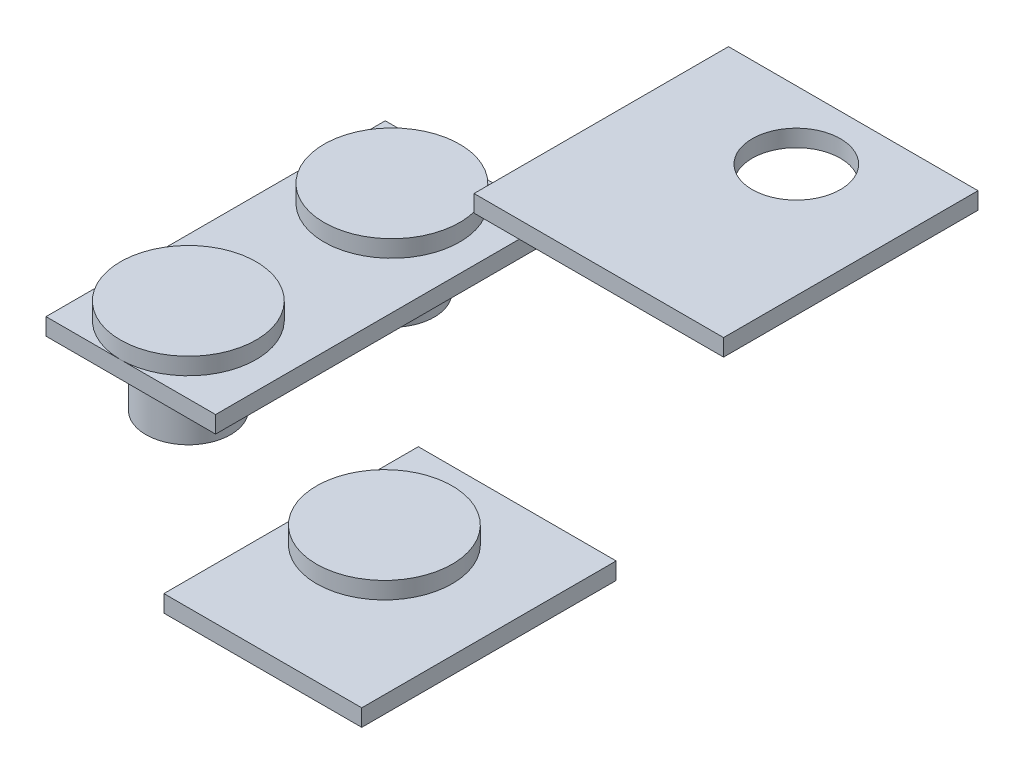
ISO-10303-21;
HEADER;
FILE_DESCRIPTION(('STEP AP214'),'2;1');
FILE_NAME('part.step','',(''),(''),'','','');
FILE_SCHEMA(('AUTOMOTIVE_DESIGN { 1 0 10303 214 1 1 1 1 }'));
ENDSEC;
DATA;
#1=APPLICATION_CONTEXT('core data for automotive mechanical design processes');
#2=APPLICATION_PROTOCOL_DEFINITION('international standard','automotive_design',2000,#1);
#3=PRODUCT_CONTEXT('',#1,'mechanical');
#4=PRODUCT('Part','Part','',(#3));
#5=PRODUCT_RELATED_PRODUCT_CATEGORY('part','',(#4));
#6=PRODUCT_DEFINITION_FORMATION('','',#4);
#7=PRODUCT_DEFINITION_CONTEXT('part definition',#1,'design');
#8=PRODUCT_DEFINITION('design','',#6,#7);
#9=PRODUCT_DEFINITION_SHAPE('','',#8);
#10=(LENGTH_UNIT() NAMED_UNIT(*) SI_UNIT(.MILLI.,.METRE.));
#11=(NAMED_UNIT(*) PLANE_ANGLE_UNIT() SI_UNIT($,.RADIAN.));
#12=(NAMED_UNIT(*) SI_UNIT($,.STERADIAN.) SOLID_ANGLE_UNIT());
#13=UNCERTAINTY_MEASURE_WITH_UNIT(LENGTH_MEASURE(1.E-05),#10,'distance_accuracy_value','');
#14=(GEOMETRIC_REPRESENTATION_CONTEXT(3) GLOBAL_UNCERTAINTY_ASSIGNED_CONTEXT((#13)) GLOBAL_UNIT_ASSIGNED_CONTEXT((#10,
#11,#12)) REPRESENTATION_CONTEXT('',''));
#15=CARTESIAN_POINT('',(0.,0.,0.));
#16=DIRECTION('',(0.,0.,1.));
#17=DIRECTION('',(1.,0.,0.));
#18=AXIS2_PLACEMENT_3D('',#15,#16,#17);
#19=CARTESIAN_POINT('',(51.4478372223601,-74.88814220189,60.));
#20=DIRECTION('',(0.,1.,0.));
#21=DIRECTION('',(0.,0.,1.));
#22=AXIS2_PLACEMENT_3D('',#19,#20,#21);
#23=PLANE('',#22);
#24=CARTESIAN_POINT('',(51.4478372223601,-74.88814220189,60.));
#25=DIRECTION('',(0.,1.,0.));
#26=DIRECTION('',(0.,0.,1.));
#27=AXIS2_PLACEMENT_3D('',#24,#25,#26);
#28=CIRCLE('',#27,25.);
#29=CARTESIAN_POINT('',(51.4478372223601,-74.88814220189,85.));
#30=VERTEX_POINT('',#29);
#31=EDGE_CURVE('E11',#30,#30,#28,.T.);
#32=ORIENTED_EDGE('',*,*,#31,.F.);
#33=EDGE_LOOP('',(#32));
#34=FACE_BOUND('',#33,.T.);
#35=ADVANCED_FACE('F46',(#34),#23,.F.);
#36=CARTESIAN_POINT('',(51.4478372223601,-19.0420232347225,60.));
#37=DIRECTION('',(0.,1.,0.));
#38=DIRECTION('',(0.,0.,1.));
#39=AXIS2_PLACEMENT_3D('',#36,#37,#38);
#40=CYLINDRICAL_SURFACE('',#39,25.);
#41=CARTESIAN_POINT('',(51.4478372223601,-29.0420232347225,60.));
#42=DIRECTION('',(0.,1.,0.));
#43=DIRECTION('',(0.,0.,1.));
#44=AXIS2_PLACEMENT_3D('',#41,#42,#43);
#45=CIRCLE('',#44,25.);
#46=CARTESIAN_POINT('',(51.4478372223601,-29.0420232347225,85.));
#47=VERTEX_POINT('',#46);
#48=EDGE_CURVE('E52',#47,#47,#45,.T.);
#49=ORIENTED_EDGE('',*,*,#48,.F.);
#50=EDGE_LOOP('',(#49));
#51=FACE_BOUND('',#50,.T.);
#52=ORIENTED_EDGE('',*,*,#31,.T.);
#53=EDGE_LOOP('',(#52));
#54=FACE_BOUND('',#53,.T.);
#55=ADVANCED_FACE('F76',(#51,#54),#40,.T.);
#56=CARTESIAN_POINT('',(76.4478372223601,-29.0420232347225,60.));
#57=DIRECTION('',(0.,1.,0.));
#58=DIRECTION('',(0.,0.,1.));
#59=AXIS2_PLACEMENT_3D('',#56,#57,#58);
#60=PLANE('',#59);
#61=CARTESIAN_POINT('',(51.4478372223601,-29.0420232347225,60.));
#62=DIRECTION('',(0.,1.,0.));
#63=DIRECTION('',(0.,0.,1.));
#64=AXIS2_PLACEMENT_3D('',#61,#62,#63);
#65=CIRCLE('',#64,40.);
#66=CARTESIAN_POINT('',(51.4478372223601,-29.0420232347225,100.));
#67=VERTEX_POINT('',#66);
#68=EDGE_CURVE('E56',#67,#67,#65,.T.);
#69=ORIENTED_EDGE('',*,*,#68,.F.);
#70=EDGE_LOOP('',(#69));
#71=FACE_BOUND('',#70,.T.);
#72=ORIENTED_EDGE('',*,*,#48,.T.);
#73=EDGE_LOOP('',(#72));
#74=FACE_BOUND('',#73,.T.);
#75=ADVANCED_FACE('F71',(#71,#74),#60,.F.);
#76=CARTESIAN_POINT('',(51.4478372223601,-19.0420232347225,60.));
#77=DIRECTION('',(0.,1.,0.));
#78=DIRECTION('',(0.,0.,1.));
#79=AXIS2_PLACEMENT_3D('',#76,#77,#78);
#80=CYLINDRICAL_SURFACE('',#79,40.);
#81=CARTESIAN_POINT('',(51.4478372223601,-19.0420232347225,60.));
#82=DIRECTION('',(0.,1.,0.));
#83=DIRECTION('',(0.,0.,1.));
#84=AXIS2_PLACEMENT_3D('',#81,#82,#83);
#85=CIRCLE('',#84,40.);
#86=CARTESIAN_POINT('',(51.4478372223601,-19.0420232347225,100.));
#87=VERTEX_POINT('',#86);
#88=EDGE_CURVE('E60',#87,#87,#85,.T.);
#89=ORIENTED_EDGE('',*,*,#88,.F.);
#90=EDGE_LOOP('',(#89));
#91=FACE_BOUND('',#90,.T.);
#92=ORIENTED_EDGE('',*,*,#68,.T.);
#93=EDGE_LOOP('',(#92));
#94=FACE_BOUND('',#93,.T.);
#95=ADVANCED_FACE('F68',(#91,#94),#80,.T.);
#96=CARTESIAN_POINT('',(91.4478372223601,-19.0420232347225,60.));
#97=DIRECTION('',(0.,-1.,0.));
#98=DIRECTION('',(0.,0.,-1.));
#99=AXIS2_PLACEMENT_3D('',#96,#97,#98);
#100=PLANE('',#99);
#101=ORIENTED_EDGE('',*,*,#88,.T.);
#102=EDGE_LOOP('',(#101));
#103=FACE_BOUND('',#102,.T.);
#104=ADVANCED_FACE('F66',(#103),#100,.F.);
#105=CLOSED_SHELL('',(#35,#55,#75,#95,#104));
#106=MANIFOLD_SOLID_BREP('B2',#105);
#107=CARTESIAN_POINT('',(-64.1485548251808,37.613727010064,0.));
#108=DIRECTION('',(0.,-1.,0.));
#109=DIRECTION('',(0.,0.,-1.));
#110=AXIS2_PLACEMENT_3D('',#107,#108,#109);
#111=PLANE('',#110);
#112=CARTESIAN_POINT('',(-64.1485548251808,37.6137270100641,-60.));
#113=DIRECTION('',(0.,1.,0.));
#114=DIRECTION('',(0.,0.,1.));
#115=AXIS2_PLACEMENT_3D('',#112,#113,#114);
#116=CIRCLE('',#115,40.);
#117=CARTESIAN_POINT('',(-64.1485548251808,37.6137270100641,-20.));
#118=VERTEX_POINT('',#117);
#119=EDGE_CURVE('E139',#118,#118,#116,.T.);
#120=ORIENTED_EDGE('',*,*,#119,.T.);
#121=EDGE_LOOP('',(#120));
#122=FACE_BOUND('',#121,.T.);
#123=ADVANCED_FACE('F125',(#122),#111,.F.);
#124=CARTESIAN_POINT('',(-64.1485548251808,-18.2323919571035,0.));
#125=DIRECTION('',(0.,1.,0.));
#126=DIRECTION('',(0.,0.,1.));
#127=AXIS2_PLACEMENT_3D('',#124,#125,#126);
#128=PLANE('',#127);
#129=CARTESIAN_POINT('',(-64.1485548251808,-18.2323919571035,-60.));
#130=DIRECTION('',(0.,1.,0.));
#131=DIRECTION('',(0.,0.,1.));
#132=AXIS2_PLACEMENT_3D('',#129,#130,#131);
#133=CIRCLE('',#132,25.);
#134=CARTESIAN_POINT('',(-64.1485548251808,-18.2323919571035,-35.));
#135=VERTEX_POINT('',#134);
#136=EDGE_CURVE('E45',#135,#135,#133,.T.);
#137=ORIENTED_EDGE('',*,*,#136,.F.);
#138=EDGE_LOOP('',(#137));
#139=FACE_BOUND('',#138,.T.);
#140=ADVANCED_FACE('F159',(#139),#128,.F.);
#141=CARTESIAN_POINT('',(-64.1485548251808,37.613727010064,-60.));
#142=DIRECTION('',(0.,1.,0.));
#143=DIRECTION('',(0.,0.,1.));
#144=AXIS2_PLACEMENT_3D('',#141,#142,#143);
#145=CYLINDRICAL_SURFACE('',#144,25.);
#146=CARTESIAN_POINT('',(-64.1485548251808,27.613727010064,-60.));
#147=DIRECTION('',(0.,1.,0.));
#148=DIRECTION('',(0.,0.,1.));
#149=AXIS2_PLACEMENT_3D('',#146,#147,#148);
#150=CIRCLE('',#149,25.);
#151=CARTESIAN_POINT('',(-64.1485548251808,27.613727010064,-35.));
#152=VERTEX_POINT('',#151);
#153=EDGE_CURVE('E131',#152,#152,#150,.T.);
#154=ORIENTED_EDGE('',*,*,#153,.F.);
#155=EDGE_LOOP('',(#154));
#156=FACE_BOUND('',#155,.T.);
#157=ORIENTED_EDGE('',*,*,#136,.T.);
#158=EDGE_LOOP('',(#157));
#159=FACE_BOUND('',#158,.T.);
#160=ADVANCED_FACE('F154',(#156,#159),#145,.T.);
#161=CARTESIAN_POINT('',(-64.1485548251808,27.613727010064,0.));
#162=DIRECTION('',(0.,1.,0.));
#163=DIRECTION('',(0.,0.,1.));
#164=AXIS2_PLACEMENT_3D('',#161,#162,#163);
#165=PLANE('',#164);
#166=CARTESIAN_POINT('',(-64.1485548251808,27.613727010064,-60.));
#167=DIRECTION('',(0.,1.,0.));
#168=DIRECTION('',(0.,0.,1.));
#169=AXIS2_PLACEMENT_3D('',#166,#167,#168);
#170=CIRCLE('',#169,40.);
#171=CARTESIAN_POINT('',(-64.1485548251808,27.613727010064,-20.));
#172=VERTEX_POINT('',#171);
#173=EDGE_CURVE('E135',#172,#172,#170,.T.);
#174=ORIENTED_EDGE('',*,*,#173,.F.);
#175=EDGE_LOOP('',(#174));
#176=FACE_BOUND('',#175,.T.);
#177=ORIENTED_EDGE('',*,*,#153,.T.);
#178=EDGE_LOOP('',(#177));
#179=FACE_BOUND('',#178,.T.);
#180=ADVANCED_FACE('F149',(#176,#179),#165,.F.);
#181=CARTESIAN_POINT('',(-64.1485548251808,37.613727010064,-60.));
#182=DIRECTION('',(0.,1.,0.));
#183=DIRECTION('',(0.,0.,1.));
#184=AXIS2_PLACEMENT_3D('',#181,#182,#183);
#185=CYLINDRICAL_SURFACE('',#184,40.);
#186=ORIENTED_EDGE('',*,*,#119,.F.);
#187=EDGE_LOOP('',(#186));
#188=FACE_BOUND('',#187,.T.);
#189=ORIENTED_EDGE('',*,*,#173,.T.);
#190=EDGE_LOOP('',(#189));
#191=FACE_BOUND('',#190,.T.);
#192=ADVANCED_FACE('F146',(#188,#191),#185,.T.);
#193=CLOSED_SHELL('',(#123,#140,#160,#180,#192));
#194=MANIFOLD_SOLID_BREP('B6',#193);
#195=CARTESIAN_POINT('',(-64.1485548251808,37.613727010064,0.));
#196=DIRECTION('',(0.,-1.,0.));
#197=DIRECTION('',(0.,0.,-1.));
#198=AXIS2_PLACEMENT_3D('',#195,#196,#197);
#199=PLANE('',#198);
#200=CARTESIAN_POINT('',(-64.1485548251808,37.613727010064,60.));
#201=DIRECTION('',(0.,1.,0.));
#202=DIRECTION('',(0.,0.,1.));
#203=AXIS2_PLACEMENT_3D('',#200,#201,#202);
#204=CIRCLE('',#203,40.);
#205=CARTESIAN_POINT('',(-64.1485548251808,37.613727010064,100.));
#206=VERTEX_POINT('',#205);
#207=EDGE_CURVE('E220',#206,#206,#204,.T.);
#208=ORIENTED_EDGE('',*,*,#207,.T.);
#209=EDGE_LOOP('',(#208));
#210=FACE_BOUND('',#209,.T.);
#211=ADVANCED_FACE('F206',(#210),#199,.F.);
#212=CARTESIAN_POINT('',(-64.1485548251808,-18.2323919571035,0.));
#213=DIRECTION('',(0.,1.,0.));
#214=DIRECTION('',(0.,0.,1.));
#215=AXIS2_PLACEMENT_3D('',#212,#213,#214);
#216=PLANE('',#215);
#217=CARTESIAN_POINT('',(-64.1485548251808,-18.2323919571035,60.));
#218=DIRECTION('',(0.,1.,0.));
#219=DIRECTION('',(0.,0.,1.));
#220=AXIS2_PLACEMENT_3D('',#217,#218,#219);
#221=CIRCLE('',#220,25.);
#222=CARTESIAN_POINT('',(-64.1485548251808,-18.2323919571035,85.));
#223=VERTEX_POINT('',#222);
#224=EDGE_CURVE('E124',#223,#223,#221,.T.);
#225=ORIENTED_EDGE('',*,*,#224,.F.);
#226=EDGE_LOOP('',(#225));
#227=FACE_BOUND('',#226,.T.);
#228=ADVANCED_FACE('F240',(#227),#216,.F.);
#229=CARTESIAN_POINT('',(-64.1485548251808,37.613727010064,60.));
#230=DIRECTION('',(0.,1.,0.));
#231=DIRECTION('',(0.,0.,1.));
#232=AXIS2_PLACEMENT_3D('',#229,#230,#231);
#233=CYLINDRICAL_SURFACE('',#232,25.);
#234=CARTESIAN_POINT('',(-64.1485548251808,27.613727010064,60.));
#235=DIRECTION('',(0.,1.,0.));
#236=DIRECTION('',(0.,0.,1.));
#237=AXIS2_PLACEMENT_3D('',#234,#235,#236);
#238=CIRCLE('',#237,25.);
#239=CARTESIAN_POINT('',(-64.1485548251808,27.613727010064,85.));
#240=VERTEX_POINT('',#239);
#241=EDGE_CURVE('E212',#240,#240,#238,.T.);
#242=ORIENTED_EDGE('',*,*,#241,.F.);
#243=EDGE_LOOP('',(#242));
#244=FACE_BOUND('',#243,.T.);
#245=ORIENTED_EDGE('',*,*,#224,.T.);
#246=EDGE_LOOP('',(#245));
#247=FACE_BOUND('',#246,.T.);
#248=ADVANCED_FACE('F235',(#244,#247),#233,.T.);
#249=CARTESIAN_POINT('',(-64.1485548251808,27.613727010064,0.));
#250=DIRECTION('',(0.,1.,0.));
#251=DIRECTION('',(0.,0.,1.));
#252=AXIS2_PLACEMENT_3D('',#249,#250,#251);
#253=PLANE('',#252);
#254=CARTESIAN_POINT('',(-64.1485548251808,27.613727010064,60.));
#255=DIRECTION('',(0.,1.,0.));
#256=DIRECTION('',(0.,0.,1.));
#257=AXIS2_PLACEMENT_3D('',#254,#255,#256);
#258=CIRCLE('',#257,40.);
#259=CARTESIAN_POINT('',(-64.1485548251808,27.613727010064,100.));
#260=VERTEX_POINT('',#259);
#261=EDGE_CURVE('E216',#260,#260,#258,.T.);
#262=ORIENTED_EDGE('',*,*,#261,.F.);
#263=EDGE_LOOP('',(#262));
#264=FACE_BOUND('',#263,.T.);
#265=ORIENTED_EDGE('',*,*,#241,.T.);
#266=EDGE_LOOP('',(#265));
#267=FACE_BOUND('',#266,.T.);
#268=ADVANCED_FACE('F230',(#264,#267),#253,.F.);
#269=CARTESIAN_POINT('',(-64.1485548251808,37.613727010064,60.));
#270=DIRECTION('',(0.,1.,0.));
#271=DIRECTION('',(0.,0.,1.));
#272=AXIS2_PLACEMENT_3D('',#269,#270,#271);
#273=CYLINDRICAL_SURFACE('',#272,40.);
#274=ORIENTED_EDGE('',*,*,#207,.F.);
#275=EDGE_LOOP('',(#274));
#276=FACE_BOUND('',#275,.T.);
#277=ORIENTED_EDGE('',*,*,#261,.T.);
#278=EDGE_LOOP('',(#277));
#279=FACE_BOUND('',#278,.T.);
#280=ADVANCED_FACE('F227',(#276,#279),#273,.T.);
#281=CLOSED_SHELL('',(#211,#228,#248,#268,#280));
#282=MANIFOLD_SOLID_BREP('B40',#281);
#283=CARTESIAN_POINT('',(44.2986503895052,106.644191680443,-150.));
#284=DIRECTION('',(0.,-1.,0.));
#285=DIRECTION('',(0.,0.,-1.));
#286=AXIS2_PLACEMENT_3D('',#283,#284,#285);
#287=PLANE('',#286);
#288=CARTESIAN_POINT('',(124.298650389505,106.644191680443,-110.));
#289=DIRECTION('',(0.,-1.,0.));
#290=DIRECTION('',(0.,0.,-1.));
#291=AXIS2_PLACEMENT_3D('',#288,#289,#290);
#292=CIRCLE('',#291,26.);
#293=CARTESIAN_POINT('',(124.298650389505,106.644191680443,-136.));
#294=VERTEX_POINT('',#293);
#295=EDGE_CURVE('E357',#294,#294,#292,.T.);
#296=ORIENTED_EDGE('',*,*,#295,.F.);
#297=EDGE_LOOP('',(#296));
#298=FACE_BOUND('',#297,.T.);
#299=DIRECTION('',(1.,0.,0.));
#300=VECTOR('',#299,1.);
#301=CARTESIAN_POINT('',(44.2986503895052,106.644191680443,0.));
#302=LINE('',#301,#300);
#303=CARTESIAN_POINT('',(44.2986503895052,106.644191680443,0.));
#304=VERTEX_POINT('',#303);
#305=CARTESIAN_POINT('',(191.413161529329,106.644191680443,0.));
#306=VERTEX_POINT('',#305);
#307=EDGE_CURVE('E353',#304,#306,#302,.T.);
#308=ORIENTED_EDGE('',*,*,#307,.F.);
#309=DIRECTION('',(0.,0.,1.));
#310=VECTOR('',#309,1.);
#311=CARTESIAN_POINT('',(44.2986503895052,106.644191680443,-150.));
#312=LINE('',#311,#310);
#313=CARTESIAN_POINT('',(44.2986503895052,106.644191680443,-150.));
#314=VERTEX_POINT('',#313);
#315=EDGE_CURVE('E204',#314,#304,#312,.T.);
#316=ORIENTED_EDGE('',*,*,#315,.F.);
#317=DIRECTION('',(1.,0.,0.));
#318=VECTOR('',#317,1.);
#319=CARTESIAN_POINT('',(44.2986503895052,106.644191680443,-150.));
#320=LINE('',#319,#318);
#321=CARTESIAN_POINT('',(191.413161529329,106.644191680443,-150.));
#322=VERTEX_POINT('',#321);
#323=EDGE_CURVE('E347',#314,#322,#320,.T.);
#324=ORIENTED_EDGE('',*,*,#323,.T.);
#325=DIRECTION('',(0.,0.,1.));
#326=VECTOR('',#325,1.);
#327=CARTESIAN_POINT('',(191.413161529329,106.644191680443,-150.));
#328=LINE('',#327,#326);
#329=EDGE_CURVE('E290',#322,#306,#328,.T.);
#330=ORIENTED_EDGE('',*,*,#329,.T.);
#331=EDGE_LOOP('',(#308,#316,#324,#330));
#332=FACE_BOUND('',#331,.T.);
#333=ADVANCED_FACE('F287',(#298,#332),#287,.T.);
#334=CARTESIAN_POINT('',(44.2986503895052,106.644191680443,-150.));
#335=DIRECTION('',(1.,0.,0.));
#336=DIRECTION('',(0.,0.,-1.));
#337=AXIS2_PLACEMENT_3D('',#334,#335,#336);
#338=PLANE('',#337);
#339=DIRECTION('',(0.,1.,0.));
#340=VECTOR('',#339,1.);
#341=CARTESIAN_POINT('',(44.2986503895052,106.644191680443,0.));
#342=LINE('',#341,#340);
#343=CARTESIAN_POINT('',(44.2986503895052,116.644191680443,0.));
#344=VERTEX_POINT('',#343);
#345=EDGE_CURVE('E320',#304,#344,#342,.T.);
#346=ORIENTED_EDGE('',*,*,#345,.T.);
#347=DIRECTION('',(0.,0.,1.));
#348=VECTOR('',#347,1.);
#349=CARTESIAN_POINT('',(44.2986503895052,116.644191680443,-150.));
#350=LINE('',#349,#348);
#351=CARTESIAN_POINT('',(44.2986503895052,116.644191680443,-150.));
#352=VERTEX_POINT('',#351);
#353=EDGE_CURVE('E296',#352,#344,#350,.T.);
#354=ORIENTED_EDGE('',*,*,#353,.F.);
#355=DIRECTION('',(0.,1.,0.));
#356=VECTOR('',#355,1.);
#357=CARTESIAN_POINT('',(44.2986503895052,106.644191680443,-150.));
#358=LINE('',#357,#356);
#359=EDGE_CURVE('E335',#314,#352,#358,.T.);
#360=ORIENTED_EDGE('',*,*,#359,.F.);
#361=ORIENTED_EDGE('',*,*,#315,.T.);
#362=EDGE_LOOP('',(#346,#354,#360,#361));
#363=FACE_BOUND('',#362,.T.);
#364=ADVANCED_FACE('F364',(#363),#338,.F.);
#365=CARTESIAN_POINT('',(44.2986503895052,116.644191680443,-150.));
#366=DIRECTION('',(0.,-1.,0.));
#367=DIRECTION('',(0.,0.,-1.));
#368=AXIS2_PLACEMENT_3D('',#365,#366,#367);
#369=PLANE('',#368);
#370=CARTESIAN_POINT('',(124.298650389505,116.644191680443,-110.));
#371=DIRECTION('',(0.,1.,0.));
#372=DIRECTION('',(0.,0.,1.));
#373=AXIS2_PLACEMENT_3D('',#370,#371,#372);
#374=CIRCLE('',#373,26.);
#375=CARTESIAN_POINT('',(124.298650389505,116.644191680443,-84.));
#376=VERTEX_POINT('',#375);
#377=EDGE_CURVE('E373',#376,#376,#374,.T.);
#378=ORIENTED_EDGE('',*,*,#377,.F.);
#379=EDGE_LOOP('',(#378));
#380=FACE_BOUND('',#379,.T.);
#381=DIRECTION('',(1.,0.,0.));
#382=VECTOR('',#381,1.);
#383=CARTESIAN_POINT('',(44.2986503895052,116.644191680443,0.));
#384=LINE('',#383,#382);
#385=CARTESIAN_POINT('',(191.413161529329,116.644191680443,0.));
#386=VERTEX_POINT('',#385);
#387=EDGE_CURVE('E342',#344,#386,#384,.T.);
#388=ORIENTED_EDGE('',*,*,#387,.T.);
#389=DIRECTION('',(0.,0.,1.));
#390=VECTOR('',#389,1.);
#391=CARTESIAN_POINT('',(191.413161529329,116.644191680443,-150.));
#392=LINE('',#391,#390);
#393=CARTESIAN_POINT('',(191.413161529329,116.644191680443,-150.));
#394=VERTEX_POINT('',#393);
#395=EDGE_CURVE('E339',#394,#386,#392,.T.);
#396=ORIENTED_EDGE('',*,*,#395,.F.);
#397=DIRECTION('',(1.,0.,0.));
#398=VECTOR('',#397,1.);
#399=CARTESIAN_POINT('',(44.2986503895052,116.644191680443,-150.));
#400=LINE('',#399,#398);
#401=EDGE_CURVE('E332',#352,#394,#400,.T.);
#402=ORIENTED_EDGE('',*,*,#401,.F.);
#403=ORIENTED_EDGE('',*,*,#353,.T.);
#404=EDGE_LOOP('',(#388,#396,#402,#403));
#405=FACE_BOUND('',#404,.T.);
#406=ADVANCED_FACE('F340',(#380,#405),#369,.F.);
#407=CARTESIAN_POINT('',(191.413161529329,116.644191680443,-150.));
#408=DIRECTION('',(-1.,0.,0.));
#409=DIRECTION('',(0.,0.,1.));
#410=AXIS2_PLACEMENT_3D('',#407,#408,#409);
#411=PLANE('',#410);
#412=DIRECTION('',(0.,-1.,0.));
#413=VECTOR('',#412,1.);
#414=CARTESIAN_POINT('',(191.413161529329,116.644191680443,0.));
#415=LINE('',#414,#413);
#416=EDGE_CURVE('E356',#386,#306,#415,.T.);
#417=ORIENTED_EDGE('',*,*,#416,.T.);
#418=ORIENTED_EDGE('',*,*,#329,.F.);
#419=DIRECTION('',(0.,-1.,0.));
#420=VECTOR('',#419,1.);
#421=CARTESIAN_POINT('',(191.413161529329,116.644191680443,-150.));
#422=LINE('',#421,#420);
#423=EDGE_CURVE('E329',#394,#322,#422,.T.);
#424=ORIENTED_EDGE('',*,*,#423,.F.);
#425=ORIENTED_EDGE('',*,*,#395,.T.);
#426=EDGE_LOOP('',(#417,#418,#424,#425));
#427=FACE_BOUND('',#426,.T.);
#428=ADVANCED_FACE('F346',(#427),#411,.F.);
#429=CARTESIAN_POINT('',(0.,0.,-150.));
#430=DIRECTION('',(0.,0.,-1.));
#431=DIRECTION('',(-1.,0.,0.));
#432=AXIS2_PLACEMENT_3D('',#429,#430,#431);
#433=PLANE('',#432);
#434=ORIENTED_EDGE('',*,*,#323,.F.);
#435=ORIENTED_EDGE('',*,*,#359,.T.);
#436=ORIENTED_EDGE('',*,*,#401,.T.);
#437=ORIENTED_EDGE('',*,*,#423,.T.);
#438=EDGE_LOOP('',(#434,#435,#436,#437));
#439=FACE_BOUND('',#438,.T.);
#440=ADVANCED_FACE('F334',(#439),#433,.T.);
#441=CARTESIAN_POINT('',(0.,0.,0.));
#442=DIRECTION('',(0.,0.,-1.));
#443=DIRECTION('',(-1.,0.,0.));
#444=AXIS2_PLACEMENT_3D('',#441,#442,#443);
#445=PLANE('',#444);
#446=ORIENTED_EDGE('',*,*,#307,.T.);
#447=ORIENTED_EDGE('',*,*,#416,.F.);
#448=ORIENTED_EDGE('',*,*,#387,.F.);
#449=ORIENTED_EDGE('',*,*,#345,.F.);
#450=EDGE_LOOP('',(#446,#447,#448,#449));
#451=FACE_BOUND('',#450,.T.);
#452=ADVANCED_FACE('F362',(#451),#445,.F.);
#453=CARTESIAN_POINT('',(124.298650389505,116.644191680443,-110.));
#454=DIRECTION('',(0.,1.,0.));
#455=DIRECTION('',(0.,0.,1.));
#456=AXIS2_PLACEMENT_3D('',#453,#454,#455);
#457=CYLINDRICAL_SURFACE('',#456,26.);
#458=ORIENTED_EDGE('',*,*,#295,.T.);
#459=EDGE_LOOP('',(#458));
#460=FACE_BOUND('',#459,.T.);
#461=ORIENTED_EDGE('',*,*,#377,.T.);
#462=EDGE_LOOP('',(#461));
#463=FACE_BOUND('',#462,.T.);
#464=ADVANCED_FACE('F378',(#460,#463),#457,.F.);
#465=CLOSED_SHELL('',(#333,#364,#406,#428,#440,#452,#464));
#466=MANIFOLD_SOLID_BREP('B119',#465);
#467=CARTESIAN_POINT('',(11.4478372223601,-39.0420232347225,150.));
#468=DIRECTION('',(0.,1.,0.));
#469=DIRECTION('',(0.,0.,1.));
#470=AXIS2_PLACEMENT_3D('',#467,#468,#469);
#471=PLANE('',#470);
#472=CARTESIAN_POINT('',(51.4478372223601,-39.0420232347225,60.));
#473=DIRECTION('',(0.,1.,0.));
#474=DIRECTION('',(0.,0.,1.));
#475=AXIS2_PLACEMENT_3D('',#472,#473,#474);
#476=CIRCLE('',#475,26.);
#477=CARTESIAN_POINT('',(51.4478372223601,-39.0420232347225,86.));
#478=VERTEX_POINT('',#477);
#479=EDGE_CURVE('E506',#478,#478,#476,.T.);
#480=ORIENTED_EDGE('',*,*,#479,.T.);
#481=EDGE_LOOP('',(#480));
#482=FACE_BOUND('',#481,.T.);
#483=DIRECTION('',(1.,0.,0.));
#484=VECTOR('',#483,1.);
#485=CARTESIAN_POINT('',(11.4478372223601,-39.0420232347225,0.));
#486=LINE('',#485,#484);
#487=CARTESIAN_POINT('',(11.4478372223601,-39.0420232347225,0.));
#488=VERTEX_POINT('',#487);
#489=CARTESIAN_POINT('',(128.092028902803,-39.0420232347225,0.));
#490=VERTEX_POINT('',#489);
#491=EDGE_CURVE('E504',#488,#490,#486,.T.);
#492=ORIENTED_EDGE('',*,*,#491,.T.);
#493=DIRECTION('',(0.,0.,-1.));
#494=VECTOR('',#493,1.);
#495=CARTESIAN_POINT('',(128.092028902803,-39.0420232347225,150.));
#496=LINE('',#495,#494);
#497=CARTESIAN_POINT('',(128.092028902803,-39.0420232347225,150.));
#498=VERTEX_POINT('',#497);
#499=EDGE_CURVE('E285',#498,#490,#496,.T.);
#500=ORIENTED_EDGE('',*,*,#499,.F.);
#501=DIRECTION('',(1.,0.,0.));
#502=VECTOR('',#501,1.);
#503=CARTESIAN_POINT('',(11.4478372223601,-39.0420232347225,150.));
#504=LINE('',#503,#502);
#505=CARTESIAN_POINT('',(11.4478372223601,-39.0420232347225,150.));
#506=VERTEX_POINT('',#505);
#507=EDGE_CURVE('E481',#506,#498,#504,.T.);
#508=ORIENTED_EDGE('',*,*,#507,.F.);
#509=DIRECTION('',(0.,0.,-1.));
#510=VECTOR('',#509,1.);
#511=CARTESIAN_POINT('',(11.4478372223601,-39.0420232347225,150.));
#512=LINE('',#511,#510);
#513=EDGE_CURVE('E457',#506,#488,#512,.T.);
#514=ORIENTED_EDGE('',*,*,#513,.T.);
#515=EDGE_LOOP('',(#492,#500,#508,#514));
#516=FACE_BOUND('',#515,.T.);
#517=ADVANCED_FACE('F441',(#482,#516),#471,.F.);
#518=CARTESIAN_POINT('',(128.092028902803,-29.0420232347225,150.));
#519=DIRECTION('',(1.,0.,0.));
#520=DIRECTION('',(0.,0.,-1.));
#521=AXIS2_PLACEMENT_3D('',#518,#519,#520);
#522=PLANE('',#521);
#523=DIRECTION('',(0.,-1.,0.));
#524=VECTOR('',#523,1.);
#525=CARTESIAN_POINT('',(128.092028902803,-29.0420232347225,0.));
#526=LINE('',#525,#524);
#527=CARTESIAN_POINT('',(128.092028902803,-29.0420232347225,0.));
#528=VERTEX_POINT('',#527);
#529=EDGE_CURVE('E490',#528,#490,#526,.T.);
#530=ORIENTED_EDGE('',*,*,#529,.F.);
#531=DIRECTION('',(0.,0.,-1.));
#532=VECTOR('',#531,1.);
#533=CARTESIAN_POINT('',(128.092028902803,-29.0420232347225,150.));
#534=LINE('',#533,#532);
#535=CARTESIAN_POINT('',(128.092028902803,-29.0420232347225,150.));
#536=VERTEX_POINT('',#535);
#537=EDGE_CURVE('E449',#536,#528,#534,.T.);
#538=ORIENTED_EDGE('',*,*,#537,.F.);
#539=DIRECTION('',(0.,-1.,0.));
#540=VECTOR('',#539,1.);
#541=CARTESIAN_POINT('',(128.092028902803,-29.0420232347225,150.));
#542=LINE('',#541,#540);
#543=EDGE_CURVE('E488',#536,#498,#542,.T.);
#544=ORIENTED_EDGE('',*,*,#543,.T.);
#545=ORIENTED_EDGE('',*,*,#499,.T.);
#546=EDGE_LOOP('',(#530,#538,#544,#545));
#547=FACE_BOUND('',#546,.T.);
#548=ADVANCED_FACE('F487',(#547),#522,.T.);
#549=CARTESIAN_POINT('',(11.4478372223601,-29.0420232347225,150.));
#550=DIRECTION('',(0.,1.,0.));
#551=DIRECTION('',(0.,0.,1.));
#552=AXIS2_PLACEMENT_3D('',#549,#550,#551);
#553=PLANE('',#552);
#554=CARTESIAN_POINT('',(51.4478372223601,-29.0420232347225,60.));
#555=DIRECTION('',(0.,1.,0.));
#556=DIRECTION('',(0.,0.,1.));
#557=AXIS2_PLACEMENT_3D('',#554,#555,#556);
#558=CIRCLE('',#557,26.);
#559=CARTESIAN_POINT('',(51.4478372223601,-29.0420232347225,86.));
#560=VERTEX_POINT('',#559);
#561=EDGE_CURVE('E518',#560,#560,#558,.T.);
#562=ORIENTED_EDGE('',*,*,#561,.F.);
#563=EDGE_LOOP('',(#562));
#564=FACE_BOUND('',#563,.T.);
#565=DIRECTION('',(1.,0.,0.));
#566=VECTOR('',#565,1.);
#567=CARTESIAN_POINT('',(11.4478372223601,-29.0420232347225,0.));
#568=LINE('',#567,#566);
#569=CARTESIAN_POINT('',(11.4478372223601,-29.0420232347225,0.));
#570=VERTEX_POINT('',#569);
#571=EDGE_CURVE('E508',#570,#528,#568,.T.);
#572=ORIENTED_EDGE('',*,*,#571,.F.);
#573=DIRECTION('',(0.,0.,-1.));
#574=VECTOR('',#573,1.);
#575=CARTESIAN_POINT('',(11.4478372223601,-29.0420232347225,150.));
#576=LINE('',#575,#574);
#577=CARTESIAN_POINT('',(11.4478372223601,-29.0420232347225,150.));
#578=VERTEX_POINT('',#577);
#579=EDGE_CURVE('E470',#578,#570,#576,.T.);
#580=ORIENTED_EDGE('',*,*,#579,.F.);
#581=DIRECTION('',(1.,0.,0.));
#582=VECTOR('',#581,1.);
#583=CARTESIAN_POINT('',(11.4478372223601,-29.0420232347225,150.));
#584=LINE('',#583,#582);
#585=EDGE_CURVE('E496',#578,#536,#584,.T.);
#586=ORIENTED_EDGE('',*,*,#585,.T.);
#587=ORIENTED_EDGE('',*,*,#537,.T.);
#588=EDGE_LOOP('',(#572,#580,#586,#587));
#589=FACE_BOUND('',#588,.T.);
#590=ADVANCED_FACE('F498',(#564,#589),#553,.T.);
#591=CARTESIAN_POINT('',(11.4478372223601,-39.0420232347225,150.));
#592=DIRECTION('',(-1.,0.,0.));
#593=DIRECTION('',(0.,0.,1.));
#594=AXIS2_PLACEMENT_3D('',#591,#592,#593);
#595=PLANE('',#594);
#596=DIRECTION('',(0.,1.,0.));
#597=VECTOR('',#596,1.);
#598=CARTESIAN_POINT('',(11.4478372223601,-39.0420232347225,0.));
#599=LINE('',#598,#597);
#600=EDGE_CURVE('E510',#488,#570,#599,.T.);
#601=ORIENTED_EDGE('',*,*,#600,.F.);
#602=ORIENTED_EDGE('',*,*,#513,.F.);
#603=DIRECTION('',(0.,1.,0.));
#604=VECTOR('',#603,1.);
#605=CARTESIAN_POINT('',(11.4478372223601,-39.0420232347225,150.));
#606=LINE('',#605,#604);
#607=EDGE_CURVE('E499',#506,#578,#606,.T.);
#608=ORIENTED_EDGE('',*,*,#607,.T.);
#609=ORIENTED_EDGE('',*,*,#579,.T.);
#610=EDGE_LOOP('',(#601,#602,#608,#609));
#611=FACE_BOUND('',#610,.T.);
#612=ADVANCED_FACE('F525',(#611),#595,.T.);
#613=CARTESIAN_POINT('',(0.,0.,150.));
#614=DIRECTION('',(0.,0.,-1.));
#615=DIRECTION('',(-1.,0.,0.));
#616=AXIS2_PLACEMENT_3D('',#613,#614,#615);
#617=PLANE('',#616);
#618=ORIENTED_EDGE('',*,*,#507,.T.);
#619=ORIENTED_EDGE('',*,*,#543,.F.);
#620=ORIENTED_EDGE('',*,*,#585,.F.);
#621=ORIENTED_EDGE('',*,*,#607,.F.);
#622=EDGE_LOOP('',(#618,#619,#620,#621));
#623=FACE_BOUND('',#622,.T.);
#624=ADVANCED_FACE('F495',(#623),#617,.F.);
#625=CARTESIAN_POINT('',(0.,0.,0.));
#626=DIRECTION('',(0.,0.,-1.));
#627=DIRECTION('',(-1.,0.,0.));
#628=AXIS2_PLACEMENT_3D('',#625,#626,#627);
#629=PLANE('',#628);
#630=ORIENTED_EDGE('',*,*,#491,.F.);
#631=ORIENTED_EDGE('',*,*,#600,.T.);
#632=ORIENTED_EDGE('',*,*,#571,.T.);
#633=ORIENTED_EDGE('',*,*,#529,.T.);
#634=EDGE_LOOP('',(#630,#631,#632,#633));
#635=FACE_BOUND('',#634,.T.);
#636=ADVANCED_FACE('F537',(#635),#629,.T.);
#637=CARTESIAN_POINT('',(51.4478372223601,-29.0420232347225,60.));
#638=DIRECTION('',(0.,1.,0.));
#639=DIRECTION('',(0.,0.,1.));
#640=AXIS2_PLACEMENT_3D('',#637,#638,#639);
#641=CYLINDRICAL_SURFACE('',#640,26.);
#642=ORIENTED_EDGE('',*,*,#479,.F.);
#643=EDGE_LOOP('',(#642));
#644=FACE_BOUND('',#643,.T.);
#645=ORIENTED_EDGE('',*,*,#561,.T.);
#646=EDGE_LOOP('',(#645));
#647=FACE_BOUND('',#646,.T.);
#648=ADVANCED_FACE('F522',(#644,#647),#641,.F.);
#649=CLOSED_SHELL('',(#517,#548,#590,#612,#624,#636,#648));
#650=MANIFOLD_SOLID_BREP('B198',#649);
#651=CARTESIAN_POINT('',(-8.07221118130586,27.613727010064,100.));
#652=DIRECTION('',(0.,-1.,0.));
#653=DIRECTION('',(0.,0.,-1.));
#654=AXIS2_PLACEMENT_3D('',#651,#652,#653);
#655=PLANE('',#654);
#656=CARTESIAN_POINT('',(-64.1485548251808,27.613727010064,60.));
#657=DIRECTION('',(0.,1.,0.));
#658=DIRECTION('',(0.,0.,1.));
#659=AXIS2_PLACEMENT_3D('',#656,#657,#658);
#660=CIRCLE('',#659,26.);
#661=CARTESIAN_POINT('',(-64.1485548251808,27.613727010064,86.));
#662=VERTEX_POINT('',#661);
#663=EDGE_CURVE('E668',#662,#662,#660,.T.);
#664=ORIENTED_EDGE('',*,*,#663,.F.);
#665=EDGE_LOOP('',(#664));
#666=FACE_BOUND('',#665,.T.);
#667=CARTESIAN_POINT('',(-64.1485548251808,27.613727010064,-60.));
#668=DIRECTION('',(0.,1.,0.));
#669=DIRECTION('',(0.,0.,1.));
#670=AXIS2_PLACEMENT_3D('',#667,#668,#669);
#671=CIRCLE('',#670,26.);
#672=CARTESIAN_POINT('',(-64.1485548251808,27.613727010064,-34.));
#673=VERTEX_POINT('',#672);
#674=EDGE_CURVE('E665',#673,#673,#671,.T.);
#675=ORIENTED_EDGE('',*,*,#674,.F.);
#676=EDGE_LOOP('',(#675));
#677=FACE_BOUND('',#676,.T.);
#678=DIRECTION('',(-1.,0.,0.));
#679=VECTOR('',#678,1.);
#680=CARTESIAN_POINT('',(-8.07221118130586,27.613727010064,-100.));
#681=LINE('',#680,#679);
#682=CARTESIAN_POINT('',(-8.07221118130586,27.613727010064,-100.));
#683=VERTEX_POINT('',#682);
#684=CARTESIAN_POINT('',(-108.0529469074,27.613727010064,-100.));
#685=VERTEX_POINT('',#684);
#686=EDGE_CURVE('E651',#683,#685,#681,.T.);
#687=ORIENTED_EDGE('',*,*,#686,.T.);
#688=DIRECTION('',(0.,0.,-1.));
#689=VECTOR('',#688,1.);
#690=CARTESIAN_POINT('',(-108.0529469074,27.613727010064,100.));
#691=LINE('',#690,#689);
#692=CARTESIAN_POINT('',(-108.0529469074,27.613727010064,100.));
#693=VERTEX_POINT('',#692);
#694=EDGE_CURVE('E439',#693,#685,#691,.T.);
#695=ORIENTED_EDGE('',*,*,#694,.F.);
#696=DIRECTION('',(-1.,0.,0.));
#697=VECTOR('',#696,1.);
#698=CARTESIAN_POINT('',(-8.07221118130586,27.613727010064,100.));
#699=LINE('',#698,#697);
#700=CARTESIAN_POINT('',(-8.07221118130586,27.613727010064,100.));
#701=VERTEX_POINT('',#700);
#702=EDGE_CURVE('E627',#701,#693,#699,.T.);
#703=ORIENTED_EDGE('',*,*,#702,.F.);
#704=DIRECTION('',(0.,0.,-1.));
#705=VECTOR('',#704,1.);
#706=CARTESIAN_POINT('',(-8.07221118130586,27.613727010064,100.));
#707=LINE('',#706,#705);
#708=EDGE_CURVE('E603',#701,#683,#707,.T.);
#709=ORIENTED_EDGE('',*,*,#708,.T.);
#710=EDGE_LOOP('',(#687,#695,#703,#709));
#711=FACE_BOUND('',#710,.T.);
#712=ADVANCED_FACE('F586',(#666,#677,#711),#655,.F.);
#713=CARTESIAN_POINT('',(-108.0529469074,17.613727010064,100.));
#714=DIRECTION('',(-1.,0.,0.));
#715=DIRECTION('',(0.,0.,1.));
#716=AXIS2_PLACEMENT_3D('',#713,#714,#715);
#717=PLANE('',#716);
#718=DIRECTION('',(0.,1.,0.));
#719=VECTOR('',#718,1.);
#720=CARTESIAN_POINT('',(-108.0529469074,17.613727010064,-100.));
#721=LINE('',#720,#719);
#722=CARTESIAN_POINT('',(-108.0529469074,17.613727010064,-100.));
#723=VERTEX_POINT('',#722);
#724=EDGE_CURVE('E636',#723,#685,#721,.T.);
#725=ORIENTED_EDGE('',*,*,#724,.F.);
#726=DIRECTION('',(0.,0.,-1.));
#727=VECTOR('',#726,1.);
#728=CARTESIAN_POINT('',(-108.0529469074,17.613727010064,100.));
#729=LINE('',#728,#727);
#730=CARTESIAN_POINT('',(-108.0529469074,17.613727010064,100.));
#731=VERTEX_POINT('',#730);
#732=EDGE_CURVE('E595',#731,#723,#729,.T.);
#733=ORIENTED_EDGE('',*,*,#732,.F.);
#734=DIRECTION('',(0.,1.,0.));
#735=VECTOR('',#734,1.);
#736=CARTESIAN_POINT('',(-108.0529469074,17.613727010064,100.));
#737=LINE('',#736,#735);
#738=EDGE_CURVE('E634',#731,#693,#737,.T.);
#739=ORIENTED_EDGE('',*,*,#738,.T.);
#740=ORIENTED_EDGE('',*,*,#694,.T.);
#741=EDGE_LOOP('',(#725,#733,#739,#740));
#742=FACE_BOUND('',#741,.T.);
#743=ADVANCED_FACE('F633',(#742),#717,.T.);
#744=CARTESIAN_POINT('',(-8.07221118130586,17.613727010064,100.));
#745=DIRECTION('',(0.,-1.,0.));
#746=DIRECTION('',(0.,0.,-1.));
#747=AXIS2_PLACEMENT_3D('',#744,#745,#746);
#748=PLANE('',#747);
#749=CARTESIAN_POINT('',(-64.1485548251808,17.613727010064,60.));
#750=DIRECTION('',(0.,-1.,0.));
#751=DIRECTION('',(0.,0.,-1.));
#752=AXIS2_PLACEMENT_3D('',#749,#750,#751);
#753=CIRCLE('',#752,26.);
#754=CARTESIAN_POINT('',(-64.1485548251808,17.613727010064,34.));
#755=VERTEX_POINT('',#754);
#756=EDGE_CURVE('E589',#755,#755,#753,.T.);
#757=ORIENTED_EDGE('',*,*,#756,.F.);
#758=EDGE_LOOP('',(#757));
#759=FACE_BOUND('',#758,.T.);
#760=CARTESIAN_POINT('',(-64.1485548251808,17.613727010064,-60.));
#761=DIRECTION('',(0.,-1.,0.));
#762=DIRECTION('',(0.,0.,-1.));
#763=AXIS2_PLACEMENT_3D('',#760,#761,#762);
#764=CIRCLE('',#763,26.);
#765=CARTESIAN_POINT('',(-64.1485548251808,17.613727010064,-86.));
#766=VERTEX_POINT('',#765);
#767=EDGE_CURVE('E653',#766,#766,#764,.T.);
#768=ORIENTED_EDGE('',*,*,#767,.F.);
#769=EDGE_LOOP('',(#768));
#770=FACE_BOUND('',#769,.T.);
#771=DIRECTION('',(1.,0.,0.));
#772=VECTOR('',#771,1.);
#773=CARTESIAN_POINT('',(-8.07221118130586,17.613727010064,-100.));
#774=LINE('',#773,#772);
#775=CARTESIAN_POINT('',(-8.07221118130586,17.613727010064,-100.));
#776=VERTEX_POINT('',#775);
#777=EDGE_CURVE('E655',#776,#723,#774,.F.);
#778=ORIENTED_EDGE('',*,*,#777,.F.);
#779=DIRECTION('',(0.,0.,-1.));
#780=VECTOR('',#779,1.);
#781=CARTESIAN_POINT('',(-8.07221118130586,17.613727010064,100.));
#782=LINE('',#781,#780);
#783=CARTESIAN_POINT('',(-8.07221118130586,17.613727010064,100.));
#784=VERTEX_POINT('',#783);
#785=EDGE_CURVE('E616',#784,#776,#782,.T.);
#786=ORIENTED_EDGE('',*,*,#785,.F.);
#787=DIRECTION('',(1.,0.,0.));
#788=VECTOR('',#787,1.);
#789=CARTESIAN_POINT('',(-8.07221118130586,17.613727010064,100.));
#790=LINE('',#789,#788);
#791=EDGE_CURVE('E643',#784,#731,#790,.F.);
#792=ORIENTED_EDGE('',*,*,#791,.T.);
#793=ORIENTED_EDGE('',*,*,#732,.T.);
#794=EDGE_LOOP('',(#778,#786,#792,#793));
#795=FACE_BOUND('',#794,.T.);
#796=ADVANCED_FACE('F645',(#759,#770,#795),#748,.T.);
#797=CARTESIAN_POINT('',(-8.07221118130586,27.613727010064,100.));
#798=DIRECTION('',(1.,0.,0.));
#799=DIRECTION('',(0.,0.,-1.));
#800=AXIS2_PLACEMENT_3D('',#797,#798,#799);
#801=PLANE('',#800);
#802=DIRECTION('',(0.,-1.,0.));
#803=VECTOR('',#802,1.);
#804=CARTESIAN_POINT('',(-8.07221118130586,27.613727010064,-100.));
#805=LINE('',#804,#803);
#806=EDGE_CURVE('E657',#683,#776,#805,.T.);
#807=ORIENTED_EDGE('',*,*,#806,.F.);
#808=ORIENTED_EDGE('',*,*,#708,.F.);
#809=DIRECTION('',(0.,-1.,0.));
#810=VECTOR('',#809,1.);
#811=CARTESIAN_POINT('',(-8.07221118130586,27.613727010064,100.));
#812=LINE('',#811,#810);
#813=EDGE_CURVE('E646',#701,#784,#812,.T.);
#814=ORIENTED_EDGE('',*,*,#813,.T.);
#815=ORIENTED_EDGE('',*,*,#785,.T.);
#816=EDGE_LOOP('',(#807,#808,#814,#815));
#817=FACE_BOUND('',#816,.T.);
#818=ADVANCED_FACE('F679',(#817),#801,.T.);
#819=CARTESIAN_POINT('',(0.,0.,100.));
#820=DIRECTION('',(0.,0.,-1.));
#821=DIRECTION('',(-1.,0.,0.));
#822=AXIS2_PLACEMENT_3D('',#819,#820,#821);
#823=PLANE('',#822);
#824=ORIENTED_EDGE('',*,*,#702,.T.);
#825=ORIENTED_EDGE('',*,*,#738,.F.);
#826=ORIENTED_EDGE('',*,*,#791,.F.);
#827=ORIENTED_EDGE('',*,*,#813,.F.);
#828=EDGE_LOOP('',(#824,#825,#826,#827));
#829=FACE_BOUND('',#828,.T.);
#830=ADVANCED_FACE('F642',(#829),#823,.F.);
#831=CARTESIAN_POINT('',(0.,0.,-100.));
#832=DIRECTION('',(0.,0.,-1.));
#833=DIRECTION('',(-1.,0.,0.));
#834=AXIS2_PLACEMENT_3D('',#831,#832,#833);
#835=PLANE('',#834);
#836=ORIENTED_EDGE('',*,*,#686,.F.);
#837=ORIENTED_EDGE('',*,*,#806,.T.);
#838=ORIENTED_EDGE('',*,*,#777,.T.);
#839=ORIENTED_EDGE('',*,*,#724,.T.);
#840=EDGE_LOOP('',(#836,#837,#838,#839));
#841=FACE_BOUND('',#840,.T.);
#842=ADVANCED_FACE('F686',(#841),#835,.T.);
#843=CARTESIAN_POINT('',(-64.1485548251808,27.613727010064,-60.));
#844=DIRECTION('',(0.,1.,0.));
#845=DIRECTION('',(0.,0.,1.));
#846=AXIS2_PLACEMENT_3D('',#843,#844,#845);
#847=CYLINDRICAL_SURFACE('',#846,26.);
#848=ORIENTED_EDGE('',*,*,#767,.T.);
#849=EDGE_LOOP('',(#848));
#850=FACE_BOUND('',#849,.T.);
#851=ORIENTED_EDGE('',*,*,#674,.T.);
#852=EDGE_LOOP('',(#851));
#853=FACE_BOUND('',#852,.T.);
#854=ADVANCED_FACE('F683',(#850,#853),#847,.F.);
#855=CARTESIAN_POINT('',(-64.1485548251808,27.613727010064,60.));
#856=DIRECTION('',(0.,1.,0.));
#857=DIRECTION('',(0.,0.,1.));
#858=AXIS2_PLACEMENT_3D('',#855,#856,#857);
#859=CYLINDRICAL_SURFACE('',#858,26.);
#860=ORIENTED_EDGE('',*,*,#756,.T.);
#861=EDGE_LOOP('',(#860));
#862=FACE_BOUND('',#861,.T.);
#863=ORIENTED_EDGE('',*,*,#663,.T.);
#864=EDGE_LOOP('',(#863));
#865=FACE_BOUND('',#864,.T.);
#866=ADVANCED_FACE('F675',(#862,#865),#859,.F.);
#867=CLOSED_SHELL('',(#712,#743,#796,#818,#830,#842,#854,#866));
#868=MANIFOLD_SOLID_BREP('B279',#867);
#869=ADVANCED_BREP_SHAPE_REPRESENTATION('',(#18,#106,#194,#282,#466,#650,#868),#14);
#870=SHAPE_DEFINITION_REPRESENTATION(#9,#869);
ENDSEC;
END-ISO-10303-21;
